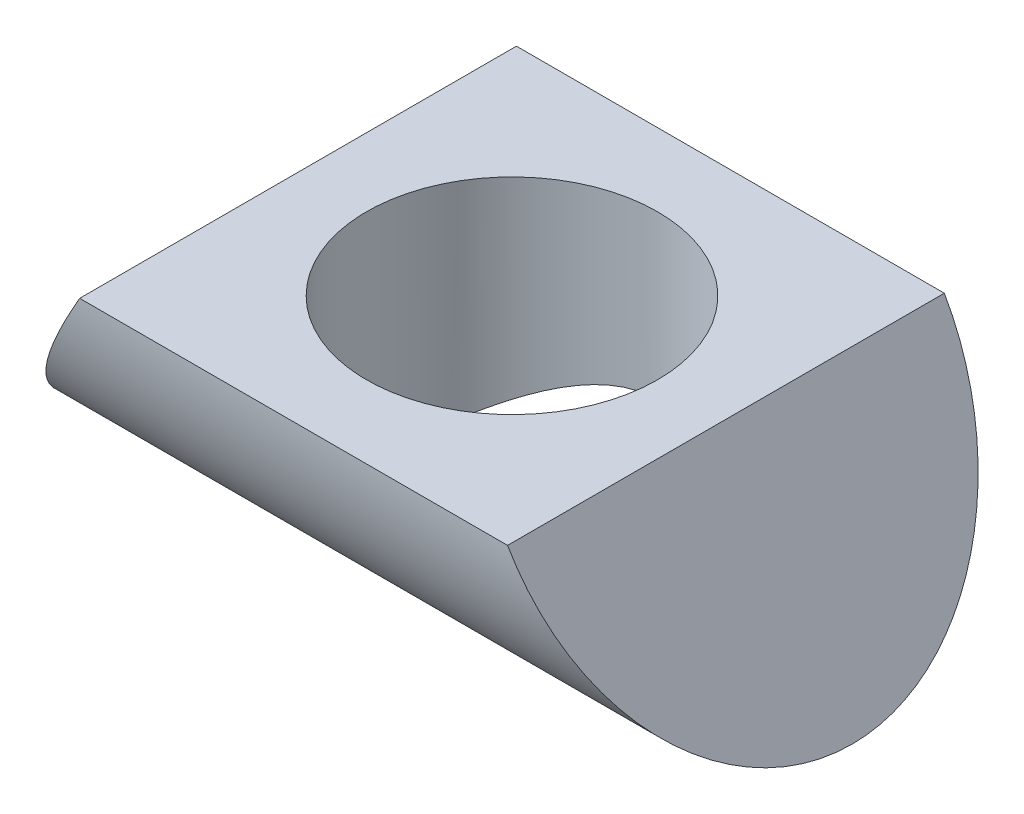
ISO-10303-21;
HEADER;
FILE_DESCRIPTION(('STEP AP214'),'2;1');
FILE_NAME('part.step','',(''),(''),'','','');
FILE_SCHEMA(('AUTOMOTIVE_DESIGN { 1 0 10303 214 1 1 1 1 }'));
ENDSEC;
DATA;
#1=APPLICATION_CONTEXT('core data for automotive mechanical design processes');
#2=APPLICATION_PROTOCOL_DEFINITION('international standard','automotive_design',2000,#1);
#3=PRODUCT_CONTEXT('',#1,'mechanical');
#4=PRODUCT('Part','Part','',(#3));
#5=PRODUCT_RELATED_PRODUCT_CATEGORY('part','',(#4));
#6=PRODUCT_DEFINITION_FORMATION('','',#4);
#7=PRODUCT_DEFINITION_CONTEXT('part definition',#1,'design');
#8=PRODUCT_DEFINITION('design','',#6,#7);
#9=PRODUCT_DEFINITION_SHAPE('','',#8);
#10=(LENGTH_UNIT() NAMED_UNIT(*) SI_UNIT(.MILLI.,.METRE.));
#11=(NAMED_UNIT(*) PLANE_ANGLE_UNIT() SI_UNIT($,.RADIAN.));
#12=(NAMED_UNIT(*) SI_UNIT($,.STERADIAN.) SOLID_ANGLE_UNIT());
#13=UNCERTAINTY_MEASURE_WITH_UNIT(LENGTH_MEASURE(1.E-05),#10,'distance_accuracy_value','');
#14=(GEOMETRIC_REPRESENTATION_CONTEXT(3) GLOBAL_UNCERTAINTY_ASSIGNED_CONTEXT((#13)) GLOBAL_UNIT_ASSIGNED_CONTEXT((#10,
#11,#12)) REPRESENTATION_CONTEXT('',''));
#15=CARTESIAN_POINT('',(0.,0.,0.));
#16=DIRECTION('',(0.,0.,1.));
#17=DIRECTION('',(1.,0.,0.));
#18=AXIS2_PLACEMENT_3D('',#15,#16,#17);
#19=CARTESIAN_POINT('',(20.,-7.145,0.));
#20=DIRECTION('',(0.,1.,0.));
#21=DIRECTION('',(0.,0.,1.));
#22=AXIS2_PLACEMENT_3D('',#19,#20,#21);
#23=CYLINDRICAL_SURFACE('',#22,4.7625);
#24=CARTESIAN_POINT('',(24.7625,-7.145,0.));
#25=CARTESIAN_POINT('',(24.7624999607599,-7.14499996085054,0.119622090175429));
#26=CARTESIAN_POINT('',(24.757987061493,-7.1419895233956,0.239244848471984));
#27=CARTESIAN_POINT('',(24.7400030295914,-7.13002122388674,0.477560029247352));
#28=CARTESIAN_POINT('',(24.7265283064278,-7.12106097806155,0.596252059540304));
#29=CARTESIAN_POINT('',(24.6908229656105,-7.09741221665453,0.831725540099603));
#30=CARTESIAN_POINT('',(24.6685924585169,-7.08272377340326,0.948507014471345));
#31=CARTESIAN_POINT('',(24.6156836593859,-7.047961207661,1.17936562543348));
#32=CARTESIAN_POINT('',(24.5850017677947,-7.02788479045627,1.2934415871757));
#33=CARTESIAN_POINT('',(24.5157708428307,-6.98291593974945,1.51753035959574));
#34=CARTESIAN_POINT('',(24.4772633875579,-6.95804899377424,1.62756115753325));
#35=CARTESIAN_POINT('',(24.3927223470122,-6.90395381735566,1.84360263595067));
#36=CARTESIAN_POINT('',(24.3466858298232,-6.87472388829785,1.94961173043461));
#37=CARTESIAN_POINT('',(24.1979912447558,-6.78135362983935,2.26076183979959));
#38=CARTESIAN_POINT('',(24.0846873734681,-6.71149245736636,2.45921930675435));
#39=CARTESIAN_POINT('',(23.8226366543039,-6.55516394278443,2.85117050899335));
#40=CARTESIAN_POINT('',(23.6716983001639,-6.46779056254724,3.04281450266474));
#41=CARTESIAN_POINT('',(23.3437846767451,-6.28742312511219,3.39990415509534));
#42=CARTESIAN_POINT('',(23.1667721121173,-6.1944211311643,3.56531157051041));
#43=CARTESIAN_POINT('',(22.8687954235376,-6.04901281963417,3.80407923290951));
#44=CARTESIAN_POINT('',(22.755581091912,-5.99598825839366,3.88688842120984));
#45=CARTESIAN_POINT('',(22.5215982833045,-5.89211912474909,4.0426136346231));
#46=CARTESIAN_POINT('',(22.40082810094,-5.84127504888466,4.11552741445248));
#47=CARTESIAN_POINT('',(22.0279723073679,-5.69474526362527,4.31840061630169));
#48=CARTESIAN_POINT('',(21.7647394892228,-5.60475120096988,4.43297749193661));
#49=CARTESIAN_POINT('',(21.2934292691911,-5.47788453758719,4.58812577569836));
#50=CARTESIAN_POINT('',(21.0913632309674,-5.43317662951165,4.64051242941904));
#51=CARTESIAN_POINT('',(20.7819825105799,-5.38244460742687,4.69903662777063));
#52=CARTESIAN_POINT('',(20.6778414670378,-5.36825741814565,4.7152001834003));
#53=CARTESIAN_POINT('',(20.4681012055211,-5.34582955192888,4.74061497985403));
#54=CARTESIAN_POINT('',(20.3625025249773,-5.33758673999299,4.74986870247671));
#55=CARTESIAN_POINT('',(20.1501608023097,-5.32736982116308,4.76132478409463));
#56=CARTESIAN_POINT('',(20.0434147874319,-5.3254229444487,4.76349651351546));
#57=CARTESIAN_POINT('',(19.8300957470024,-5.32795560849334,4.76066357623025));
#58=CARTESIAN_POINT('',(19.7235227220415,-5.33243517115462,4.7556588850659));
#59=CARTESIAN_POINT('',(19.5113387224603,-5.34763561549788,4.73855977639221));
#60=CARTESIAN_POINT('',(19.4057283089601,-5.35835992712812,4.72646146266274));
#61=CARTESIAN_POINT('',(19.196268878092,-5.38560986318741,4.69538618781722));
#62=CARTESIAN_POINT('',(19.0924205934252,-5.40213784170139,4.67640643534832));
#63=CARTESIAN_POINT('',(18.7936681769849,-5.45782374715919,4.61154709845675));
#64=CARTESIAN_POINT('',(18.6018758372872,-5.50388994486952,4.55690391598197));
#65=CARTESIAN_POINT('',(18.2301380787478,-5.60982278830196,4.42582892260214));
#66=CARTESIAN_POINT('',(18.0501965819437,-5.66969397357261,4.34938994253812));
#67=CARTESIAN_POINT('',(17.6681600811085,-5.81115373167866,4.15911799372474));
#68=CARTESIAN_POINT('',(17.4690018569451,-5.89468274240531,4.04084169211066));
#69=CARTESIAN_POINT('',(17.0909755775767,-6.06660148753352,3.77783975574481));
#70=CARTESIAN_POINT('',(16.9121329910313,-6.15499712138582,3.63308150237905));
#71=CARTESIAN_POINT('',(16.6424638926224,-6.29564500694754,3.38051372188855));
#72=CARTESIAN_POINT('',(16.5445994469987,-6.34849323050814,3.28043904484247));
#73=CARTESIAN_POINT('',(16.3576097672384,-6.45217507408821,3.07148908499707));
#74=CARTESIAN_POINT('',(16.2684817172899,-6.50300934005445,2.96261665856198));
#75=CARTESIAN_POINT('',(16.0996245920551,-6.60135162448113,2.73649061545919));
#76=CARTESIAN_POINT('',(16.0198911122948,-6.64886119738711,2.61924096805216));
#77=CARTESIAN_POINT('',(15.8705464380096,-6.73932307553438,2.37681966832429));
#78=CARTESIAN_POINT('',(15.8009321681913,-6.78227676426103,2.25165043948273));
#79=CARTESIAN_POINT('',(15.6852429572766,-6.85457004413061,2.01932187881248));
#80=CARTESIAN_POINT('',(15.6372286155646,-6.88492788431395,1.91344115816476));
#81=CARTESIAN_POINT('',(15.5487510371376,-6.94133081726881,1.69746874374937));
#82=CARTESIAN_POINT('',(15.5082862716891,-6.96737678304251,1.58737790795129));
#83=CARTESIAN_POINT('',(15.4353714583882,-7.01460484735589,1.3636032330533));
#84=CARTESIAN_POINT('',(15.402918037967,-7.03578899233126,1.24992092868115));
#85=CARTESIAN_POINT('',(15.3464299457153,-7.07282673449907,1.01967425039087));
#86=CARTESIAN_POINT('',(15.3223918827831,-7.08868247875154,0.903111057691298));
#87=CARTESIAN_POINT('',(15.2829626191875,-7.11476213953067,0.667322410616872));
#88=CARTESIAN_POINT('',(15.2676133663393,-7.12495873026208,0.548086882309801));
#89=CARTESIAN_POINT('',(15.2459798527969,-7.13934597106099,0.30848266597355));
#90=CARTESIAN_POINT('',(15.2396918587102,-7.14353909465431,0.188114465211813));
#91=CARTESIAN_POINT('',(15.2362689144584,-7.14582051990973,-0.0528302969718777));
#92=CARTESIAN_POINT('',(15.2391354848638,-7.1439078073942,-0.17340688968308));
#93=CARTESIAN_POINT('',(15.2539784756389,-7.13402471688864,-0.413741159736846));
#94=CARTESIAN_POINT('',(15.2659545079612,-7.1260545969337,-0.533498871743059));
#95=CARTESIAN_POINT('',(15.2976711636179,-7.10502528909235,-0.762856142036041));
#96=CARTESIAN_POINT('',(15.3168050427647,-7.09236437347998,-0.872576754839506));
#97=CARTESIAN_POINT('',(15.3625338035045,-7.06225322453824,-1.0897944304351));
#98=CARTESIAN_POINT('',(15.3891310894373,-7.04480144787026,-1.19729076467252));
#99=CARTESIAN_POINT('',(15.4796615024044,-6.98576733591503,-1.51540503730521));
#100=CARTESIAN_POINT('',(15.5543595382431,-6.93748831467708,-1.72183437262323));
#101=CARTESIAN_POINT('',(15.7347379913263,-6.82326313507734,-2.13121495517475));
#102=CARTESIAN_POINT('',(15.8420225472634,-6.75642314805218,-2.3331961455375));
#103=CARTESIAN_POINT('',(16.0820165175407,-6.61143457217078,-2.71699989196447));
#104=CARTESIAN_POINT('',(16.2147416527537,-6.53327899825141,-2.89880987308233));
#105=CARTESIAN_POINT('',(16.5255082027762,-6.35788360201033,-3.26746243738258));
#106=CARTESIAN_POINT('',(16.7073966337511,-6.25958020397335,-3.45055531309713));
#107=CARTESIAN_POINT('',(17.0983918752388,-6.06303035305377,-3.78528389642693));
#108=CARTESIAN_POINT('',(17.3075172856631,-5.96478398559418,-3.93689792215557));
#109=CARTESIAN_POINT('',(17.7320081683539,-5.78615175198227,-4.19451039858475));
#110=CARTESIAN_POINT('',(17.9453380223013,-5.70495773370003,-4.30328804238946));
#111=CARTESIAN_POINT('',(18.3909427802564,-5.56009052865001,-4.4889123307922));
#112=CARTESIAN_POINT('',(18.6231826706313,-5.49638587403198,-4.56581645284237));
#113=CARTESIAN_POINT('',(19.0593236226189,-5.40533186628516,-4.67305909785351));
#114=CARTESIAN_POINT('',(19.2608202703969,-5.373507259454,-4.70928116771354));
#115=CARTESIAN_POINT('',(19.6690112041493,-5.33274023060352,-4.75540924157243));
#116=CARTESIAN_POINT('',(19.8756996103853,-5.32377300635168,-4.76534377026825));
#117=CARTESIAN_POINT('',(20.2883369622541,-5.33011750166681,-4.75824363304101));
#118=CARTESIAN_POINT('',(20.4942854075471,-5.34544335371174,-4.74119326868663));
#119=CARTESIAN_POINT('',(20.8996054640814,-5.3979921432324,-4.68126360553408));
#120=CARTESIAN_POINT('',(21.0989679274327,-5.43524428836438,-4.63834985271041));
#121=CARTESIAN_POINT('',(21.53867721335,-5.53895648552548,-4.51431908812637));
#122=CARTESIAN_POINT('',(21.7757758499407,-5.61055633735245,-4.42606607697358));
#123=CARTESIAN_POINT('',(22.2287622314943,-5.769900573627,-4.21623109438575));
#124=CARTESIAN_POINT('',(22.444619620102,-5.85766756321185,-4.09460233840667));
#125=CARTESIAN_POINT('',(22.8569732844603,-6.04129680207949,-3.8185989622926));
#126=CARTESIAN_POINT('',(23.0530460843269,-6.13727724165123,-3.66366906883108));
#127=CARTESIAN_POINT('',(23.3274845179365,-6.27978539852631,-3.40951783634766));
#128=CARTESIAN_POINT('',(23.4157204535468,-6.32706510332127,-3.3211304630799));
#129=CARTESIAN_POINT('',(23.585349255793,-6.42022684715466,-3.13724765559563));
#130=CARTESIAN_POINT('',(23.6667405612463,-6.46610856581473,-3.04175060905717));
#131=CARTESIAN_POINT('',(23.8333912571222,-6.56195226227959,-2.82970362741226));
#132=CARTESIAN_POINT('',(23.9175243656384,-6.61155246747919,-2.71210084212215));
#133=CARTESIAN_POINT('',(24.0754093256093,-6.70631012345564,-2.4685010550177));
#134=CARTESIAN_POINT('',(24.1491658812882,-6.75146958463619,-2.34250789540867));
#135=CARTESIAN_POINT('',(24.2853876973041,-6.83603088699301,-2.08286564272345));
#136=CARTESIAN_POINT('',(24.3478635314851,-6.87543811324573,-1.94922387538569));
#137=CARTESIAN_POINT('',(24.4606406400474,-6.94730476729784,-1.67512148249879));
#138=CARTESIAN_POINT('',(24.5109462021358,-6.97976664154593,-1.53466327944711));
#139=CARTESIAN_POINT('',(24.588705940346,-7.0303042519022,-1.28013094206145));
#140=CARTESIAN_POINT('',(24.6187543362245,-7.04997379893799,-1.16715852997664));
#141=CARTESIAN_POINT('',(24.6705722635656,-7.0840300102546,-0.938556627684758));
#142=CARTESIAN_POINT('',(24.6923433637963,-7.09841767557501,-0.822927645378226));
#143=CARTESIAN_POINT('',(24.727294077909,-7.12156982569406,-0.589890628017114));
#144=CARTESIAN_POINT('',(24.7404788393389,-7.13033767954458,-0.472483702131162));
#145=CARTESIAN_POINT('',(24.7580819891952,-7.14205289853844,-0.236718093263768));
#146=CARTESIAN_POINT('',(24.7625000388258,-7.1450000387362,-0.118359373677063));
#147=CARTESIAN_POINT('',(24.7625,-7.145,0.));
#148=B_SPLINE_CURVE_WITH_KNOTS('',3,(#24,#25,#26,#27,#28,#29,#30,#31,#32,#33,#34,#35,#36,#37,
#38,#39,#40,#41,#42,#43,#44,#45,#46,#47,#48,#49,#50,#51,#52,#53,#54,#55,#56,#57,#58,#59,#60,#61,
#62,#63,#64,#65,#66,#67,#68,#69,#70,#71,#72,#73,#74,#75,#76,#77,#78,#79,#80,#81,#82,#83,#84,#85,
#86,#87,#88,#89,#90,#91,#92,#93,#94,#95,#96,#97,#98,#99,#100,#101,#102,#103,#104,#105,#106,#107,
#108,#109,#110,#111,#112,#113,#114,#115,#116,#117,#118,#119,#120,#121,#122,#123,#124,#125,#126,
#127,#128,#129,#130,#131,#132,#133,#134,#135,#136,#137,#138,#139,#140,#141,#142,#143,#144,#145,
#146,#147),.UNSPECIFIED.,.T.,.F.,(4,2,2,2,2,2,2,2,2,2,2,2,2,2,2,2,2,2,2,2,2,2,2,2,2,2,2,2,2,2,2,
2,2,2,2,2,2,2,2,2,2,2,2,2,2,2,2,2,2,2,2,2,2,2,2,2,2,2,2,2,2,4),(0.,0.358745604207688,
0.717635025460676,1.07651991512533,1.43555789547143,1.79273592586882,2.15005337874336,
2.86407441171265,3.63867587895713,4.41439625711711,4.86376952898094,5.31324459447041,
6.20972518564528,6.84743919045981,7.16610134986127,7.48464900053084,7.80457255312044,
8.12449719605967,8.44459772459853,8.76482824267031,9.37638955051654,9.98815224800477,
10.7243276154587,11.4614159333208,11.9098102048336,12.358059476677,12.8060977516274,
13.2539995788928,13.614111928347,13.9741512783722,14.3340388016871,14.6937811352401,
15.0552457354559,15.416561363494,15.7779370090771,16.1392972615449,16.4751886252903,
16.8111883210577,17.4826277919544,18.1947848046748,18.9073833181571,19.7326560244261,
20.5584952869743,21.3142512835913,22.0686384342064,22.6874979379099,23.3056856392349,
23.924233102775,24.5436063940063,25.3281502768107,26.1137995640644,26.9137362085514,
27.3140613710997,27.7144775970126,28.1724627588178,28.630239618719,29.0875851340839,
29.5447692866921,29.899994771961,30.2551528989291,30.6100979105496,30.9650566390016),.UNSPECIFIED.);
#149=CARTESIAN_POINT('',(24.7625,-7.145,0.));
#150=VERTEX_POINT('',#149);
#151=EDGE_CURVE('E73',#150,#150,#148,.T.);
#152=ORIENTED_EDGE('',*,*,#151,.T.);
#153=EDGE_LOOP('',(#152));
#154=FACE_BOUND('',#153,.T.);
#155=CARTESIAN_POINT('',(20.,0.,0.));
#156=DIRECTION('',(0.,1.,0.));
#157=DIRECTION('',(0.,0.,-1.));
#158=AXIS2_PLACEMENT_3D('',#155,#156,#157);
#159=CIRCLE('',#158,4.7625);
#160=CARTESIAN_POINT('',(20.,0.,-4.76250000000004));
#161=VERTEX_POINT('',#160);
#162=EDGE_CURVE('E76',#161,#161,#159,.T.);
#163=ORIENTED_EDGE('',*,*,#162,.T.);
#164=EDGE_LOOP('',(#163));
#165=FACE_BOUND('',#164,.T.);
#166=ADVANCED_FACE('F34',(#154,#165),#23,.F.);
#167=CARTESIAN_POINT('',(-34.,0.,7.14500000000004));
#168=DIRECTION('',(0.,1.,0.));
#169=DIRECTION('',(0.,0.,1.));
#170=AXIS2_PLACEMENT_3D('',#167,#168,#169);
#171=PLANE('',#170);
#172=DIRECTION('',(0.,0.,1.));
#173=VECTOR('',#172,1.);
#174=CARTESIAN_POINT('',(27.0000000000001,0.,-7.14499999999996));
#175=LINE('',#174,#173);
#176=CARTESIAN_POINT('',(27.0000000000001,0.,-7.14499999999996));
#177=VERTEX_POINT('',#176);
#178=CARTESIAN_POINT('',(27.0000000000015,0.,7.14500000000004));
#179=VERTEX_POINT('',#178);
#180=EDGE_CURVE('E48',#177,#179,#175,.T.);
#181=ORIENTED_EDGE('',*,*,#180,.F.);
#182=DIRECTION('',(1.,0.,0.));
#183=VECTOR('',#182,1.);
#184=CARTESIAN_POINT('',(-33.999999999999,0.,-7.14500000000007));
#185=LINE('',#184,#183);
#186=CARTESIAN_POINT('',(12.9999999999998,0.,-7.14499999999998));
#187=VERTEX_POINT('',#186);
#188=EDGE_CURVE('E69',#187,#177,#185,.T.);
#189=ORIENTED_EDGE('',*,*,#188,.F.);
#190=DIRECTION('',(0.,0.,1.));
#191=VECTOR('',#190,1.);
#192=CARTESIAN_POINT('',(12.9999999999998,0.,-7.14499999999998));
#193=LINE('',#192,#191);
#194=CARTESIAN_POINT('',(13.,0.,7.14499999999996));
#195=VERTEX_POINT('',#194);
#196=EDGE_CURVE('E70',#187,#195,#193,.T.);
#197=ORIENTED_EDGE('',*,*,#196,.T.);
#198=DIRECTION('',(1.,0.,0.));
#199=VECTOR('',#198,1.);
#200=CARTESIAN_POINT('',(-34.,0.,7.14500000000004));
#201=LINE('',#200,#199);
#202=EDGE_CURVE('E43',#195,#179,#201,.T.);
#203=ORIENTED_EDGE('',*,*,#202,.T.);
#204=EDGE_LOOP('',(#181,#189,#197,#203));
#205=FACE_BOUND('',#204,.T.);
#206=ORIENTED_EDGE('',*,*,#162,.F.);
#207=EDGE_LOOP('',(#206));
#208=FACE_BOUND('',#207,.T.);
#209=ADVANCED_FACE('F67',(#205,#208),#171,.T.);
#210=CARTESIAN_POINT('',(-34.0000000000003,0.,-1.11022302462516E-13));
#211=DIRECTION('',(1.,0.,0.));
#212=DIRECTION('',(0.,0.,-1.));
#213=AXIS2_PLACEMENT_3D('',#210,#211,#212);
#214=CYLINDRICAL_SURFACE('',#213,7.145);
#215=CARTESIAN_POINT('',(27.0000000000001,0.,0.));
#216=DIRECTION('',(-0.866025403784437,-0.500000000000005,0.));
#217=DIRECTION('',(0.500000000000006,-0.866025403784436,0.));
#218=AXIS2_PLACEMENT_3D('',#215,#216,#217);
#219=ELLIPSE('',#218,8.25033534671978,7.145);
#220=EDGE_CURVE('E11',#179,#177,#219,.F.);
#221=ORIENTED_EDGE('',*,*,#220,.F.);
#222=ORIENTED_EDGE('',*,*,#202,.F.);
#223=CARTESIAN_POINT('',(13.,0.,0.));
#224=DIRECTION('',(0.866025403784443,-0.499999999999996,0.));
#225=DIRECTION('',(0.499999999999997,0.866025403784441,0.));
#226=AXIS2_PLACEMENT_3D('',#223,#224,#225);
#227=ELLIPSE('',#226,8.25033534671973,7.145);
#228=EDGE_CURVE('E55',#187,#195,#227,.F.);
#229=ORIENTED_EDGE('',*,*,#228,.F.);
#230=ORIENTED_EDGE('',*,*,#188,.T.);
#231=EDGE_LOOP('',(#221,#222,#229,#230));
#232=FACE_BOUND('',#231,.T.);
#233=ORIENTED_EDGE('',*,*,#151,.F.);
#234=EDGE_LOOP('',(#233));
#235=FACE_BOUND('',#234,.T.);
#236=ADVANCED_FACE('F36',(#232,#235),#214,.T.);
#237=CARTESIAN_POINT('',(12.9999999999998,0.,-7.14499999999998));
#238=DIRECTION('',(0.866025403784443,-0.499999999999996,0.));
#239=DIRECTION('',(0.499999999999997,0.866025403784441,0.));
#240=AXIS2_PLACEMENT_3D('',#237,#238,#239);
#241=PLANE('',#240);
#242=ORIENTED_EDGE('',*,*,#228,.T.);
#243=ORIENTED_EDGE('',*,*,#196,.F.);
#244=EDGE_LOOP('',(#242,#243));
#245=FACE_BOUND('',#244,.T.);
#246=ADVANCED_FACE('F88',(#245),#241,.F.);
#247=CARTESIAN_POINT('',(27.0000000000001,0.,-7.14499999999996));
#248=DIRECTION('',(-0.866025403784437,-0.500000000000005,0.));
#249=DIRECTION('',(0.500000000000006,-0.866025403784436,0.));
#250=AXIS2_PLACEMENT_3D('',#247,#248,#249);
#251=PLANE('',#250);
#252=ORIENTED_EDGE('',*,*,#220,.T.);
#253=ORIENTED_EDGE('',*,*,#180,.T.);
#254=EDGE_LOOP('',(#252,#253));
#255=FACE_BOUND('',#254,.T.);
#256=ADVANCED_FACE('F60',(#255),#251,.F.);
#257=CLOSED_SHELL('',(#166,#209,#236,#246,#256));
#258=MANIFOLD_SOLID_BREP('B2',#257);
#259=ADVANCED_BREP_SHAPE_REPRESENTATION('',(#18,#258),#14);
#260=SHAPE_DEFINITION_REPRESENTATION(#9,#259);
ENDSEC;
END-ISO-10303-21;
